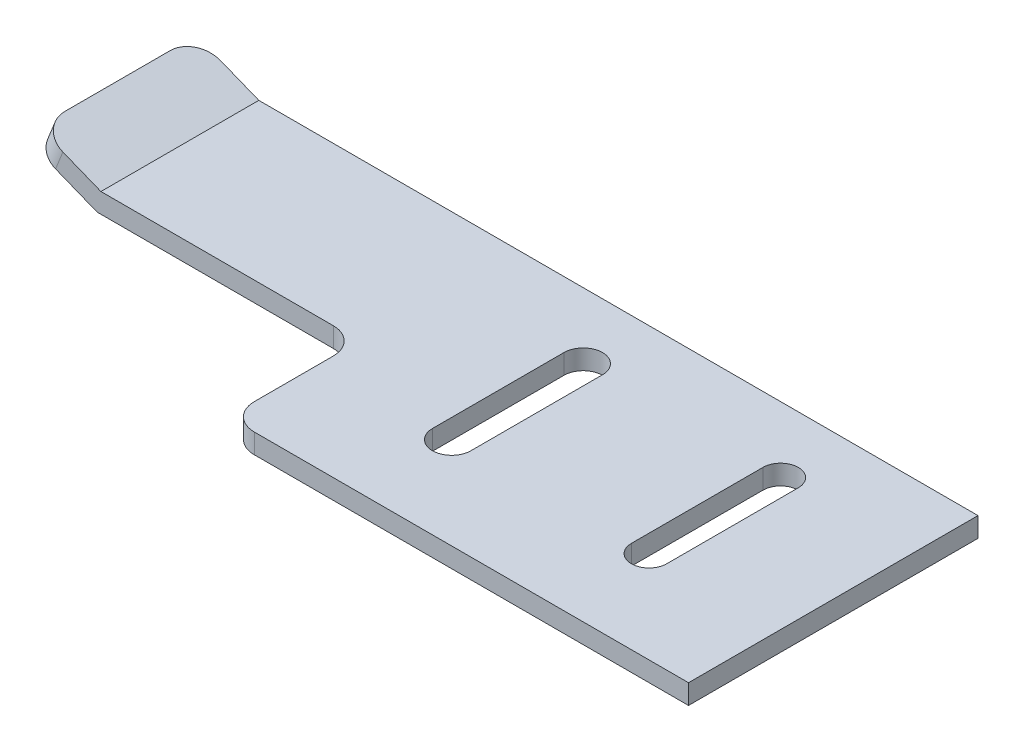
ISO-10303-21;
HEADER;
FILE_DESCRIPTION(('STEP AP214'),'2;1');
FILE_NAME('part.step','',(''),(''),'','','');
FILE_SCHEMA(('AUTOMOTIVE_DESIGN { 1 0 10303 214 1 1 1 1 }'));
ENDSEC;
DATA;
#1=APPLICATION_CONTEXT('core data for automotive mechanical design processes');
#2=APPLICATION_PROTOCOL_DEFINITION('international standard','automotive_design',2000,#1);
#3=PRODUCT_CONTEXT('',#1,'mechanical');
#4=PRODUCT('Part','Part','',(#3));
#5=PRODUCT_RELATED_PRODUCT_CATEGORY('part','',(#4));
#6=PRODUCT_DEFINITION_FORMATION('','',#4);
#7=PRODUCT_DEFINITION_CONTEXT('part definition',#1,'design');
#8=PRODUCT_DEFINITION('design','',#6,#7);
#9=PRODUCT_DEFINITION_SHAPE('','',#8);
#10=(LENGTH_UNIT() NAMED_UNIT(*) SI_UNIT(.MILLI.,.METRE.));
#11=(NAMED_UNIT(*) PLANE_ANGLE_UNIT() SI_UNIT($,.RADIAN.));
#12=(NAMED_UNIT(*) SI_UNIT($,.STERADIAN.) SOLID_ANGLE_UNIT());
#13=UNCERTAINTY_MEASURE_WITH_UNIT(LENGTH_MEASURE(1.E-05),#10,'distance_accuracy_value','');
#14=(GEOMETRIC_REPRESENTATION_CONTEXT(3) GLOBAL_UNCERTAINTY_ASSIGNED_CONTEXT((#13)) GLOBAL_UNIT_ASSIGNED_CONTEXT((#10,
#11,#12)) REPRESENTATION_CONTEXT('',''));
#15=CARTESIAN_POINT('',(0.,0.,0.));
#16=DIRECTION('',(0.,0.,1.));
#17=DIRECTION('',(1.,0.,0.));
#18=AXIS2_PLACEMENT_3D('',#15,#16,#17);
#19=CARTESIAN_POINT('',(-6.98954425613811,7.77511100339449,22.));
#20=DIRECTION('',(-0.3711350848812,-0.928578886670499,0.));
#21=DIRECTION('',(0.928578886670499,-0.3711350848812,0.));
#22=AXIS2_PLACEMENT_3D('',#19,#20,#21);
#23=PLANE('',#22);
#24=DIRECTION('',(-0.928578886670499,0.3711350848812,0.));
#25=VECTOR('',#24,1.);
#26=CARTESIAN_POINT('',(-6.98954425613811,7.77511100339449,0.));
#27=LINE('',#26,#25);
#28=CARTESIAN_POINT('',(-2.24326139015815,5.87811321503025,0.));
#29=VERTEX_POINT('',#28);
#30=CARTESIAN_POINT('',(-5.13238648279711,7.03284083363209,0.));
#31=VERTEX_POINT('',#30);
#32=EDGE_CURVE('E238',#29,#31,#27,.T.);
#33=ORIENTED_EDGE('',*,*,#32,.T.);
#34=CARTESIAN_POINT('',(-5.13238648279711,7.03284083363209,2.));
#35=DIRECTION('',(-0.3711350848812,-0.928578886670499,0.));
#36=DIRECTION('',(0.928578886670499,-0.3711350848812,0.));
#37=AXIS2_PLACEMENT_3D('',#34,#35,#36);
#38=CIRCLE('',#37,2.);
#39=CARTESIAN_POINT('',(-6.98954425613811,7.77511100339449,2.));
#40=VERTEX_POINT('',#39);
#41=EDGE_CURVE('E311',#31,#40,#38,.F.);
#42=ORIENTED_EDGE('',*,*,#41,.T.);
#43=DIRECTION('',(0.,0.,-1.));
#44=VECTOR('',#43,1.);
#45=CARTESIAN_POINT('',(-6.98954425613811,7.77511100339449,22.));
#46=LINE('',#45,#44);
#47=CARTESIAN_POINT('',(-6.98954425613811,7.77511100339449,9.99999999999999));
#48=VERTEX_POINT('',#47);
#49=EDGE_CURVE('E270',#48,#40,#46,.T.);
#50=ORIENTED_EDGE('',*,*,#49,.F.);
#51=CARTESIAN_POINT('',(-5.13238648279711,7.03284083363209,9.99999999999999));
#52=DIRECTION('',(-0.3711350848812,-0.928578886670499,0.));
#53=DIRECTION('',(0.928578886670499,-0.3711350848812,0.));
#54=AXIS2_PLACEMENT_3D('',#51,#52,#53);
#55=CIRCLE('',#54,2.);
#56=CARTESIAN_POINT('',(-5.13238648279711,7.03284083363209,12.));
#57=VERTEX_POINT('',#56);
#58=EDGE_CURVE('E309',#48,#57,#55,.F.);
#59=ORIENTED_EDGE('',*,*,#58,.T.);
#60=DIRECTION('',(0.928578886670499,-0.3711350848812,0.));
#61=VECTOR('',#60,1.);
#62=CARTESIAN_POINT('',(-6.98954425613811,7.77511100339449,12.));
#63=LINE('',#62,#61);
#64=CARTESIAN_POINT('',(-2.24326139015815,5.87811321503025,12.));
#65=VERTEX_POINT('',#64);
#66=EDGE_CURVE('E233',#57,#65,#63,.T.);
#67=ORIENTED_EDGE('',*,*,#66,.T.);
#68=DIRECTION('',(0.,0.,-1.));
#69=VECTOR('',#68,1.);
#70=CARTESIAN_POINT('',(-2.24326139015815,5.87811321503025,22.));
#71=LINE('',#70,#69);
#72=EDGE_CURVE('E246',#65,#29,#71,.T.);
#73=ORIENTED_EDGE('',*,*,#72,.T.);
#74=EDGE_LOOP('',(#33,#42,#50,#59,#67,#73));
#75=FACE_BOUND('',#74,.T.);
#76=ADVANCED_FACE('F33',(#75),#23,.F.);
#77=CARTESIAN_POINT('',(-7.54624688345991,6.38224267338874,22.));
#78=DIRECTION('',(0.928578886670499,-0.371135084881201,0.));
#79=DIRECTION('',(0.371135084881201,0.928578886670499,0.));
#80=AXIS2_PLACEMENT_3D('',#77,#78,#79);
#81=PLANE('',#80);
#82=ORIENTED_EDGE('',*,*,#49,.T.);
#83=DIRECTION('',(-0.371135084881201,-0.928578886670499,0.));
#84=VECTOR('',#83,1.);
#85=CARTESIAN_POINT('',(-7.54624688345991,6.38224267338874,2.));
#86=LINE('',#85,#84);
#87=CARTESIAN_POINT('',(-7.54624688345991,6.38224267338874,2.));
#88=VERTEX_POINT('',#87);
#89=EDGE_CURVE('E300',#40,#88,#86,.T.);
#90=ORIENTED_EDGE('',*,*,#89,.T.);
#91=DIRECTION('',(0.,0.,-1.));
#92=VECTOR('',#91,1.);
#93=CARTESIAN_POINT('',(-7.54624688345991,6.38224267338874,22.));
#94=LINE('',#93,#92);
#95=CARTESIAN_POINT('',(-7.54624688345991,6.38224267338874,9.99999999999999));
#96=VERTEX_POINT('',#95);
#97=EDGE_CURVE('E267',#96,#88,#94,.T.);
#98=ORIENTED_EDGE('',*,*,#97,.F.);
#99=DIRECTION('',(0.371135084881201,0.928578886670499,0.));
#100=VECTOR('',#99,1.);
#101=CARTESIAN_POINT('',(-7.54624688345991,6.38224267338874,9.99999999999999));
#102=LINE('',#101,#100);
#103=EDGE_CURVE('E297',#96,#48,#102,.T.);
#104=ORIENTED_EDGE('',*,*,#103,.T.);
#105=EDGE_LOOP('',(#82,#90,#98,#104));
#106=FACE_BOUND('',#105,.T.);
#107=ADVANCED_FACE('F369',(#106),#81,.F.);
#108=CARTESIAN_POINT('',(-2.53192089543921,4.37811321503025,22.));
#109=DIRECTION('',(0.3711350848812,0.928578886670499,0.));
#110=DIRECTION('',(-0.928578886670499,0.3711350848812,0.));
#111=AXIS2_PLACEMENT_3D('',#108,#109,#110);
#112=PLANE('',#111);
#113=ORIENTED_EDGE('',*,*,#97,.T.);
#114=CARTESIAN_POINT('',(-5.68908911011891,5.63997250362634,2.));
#115=DIRECTION('',(0.3711350848812,0.928578886670499,0.));
#116=DIRECTION('',(-0.928578886670499,0.3711350848812,0.));
#117=AXIS2_PLACEMENT_3D('',#114,#115,#116);
#118=CIRCLE('',#117,2.);
#119=CARTESIAN_POINT('',(-5.68908911011891,5.63997250362634,0.));
#120=VERTEX_POINT('',#119);
#121=EDGE_CURVE('E305',#88,#120,#118,.F.);
#122=ORIENTED_EDGE('',*,*,#121,.T.);
#123=DIRECTION('',(0.928578886670499,-0.3711350848812,0.));
#124=VECTOR('',#123,1.);
#125=CARTESIAN_POINT('',(-2.53192089543921,4.37811321503025,0.));
#126=LINE('',#125,#124);
#127=CARTESIAN_POINT('',(-2.53192089543921,4.37811321503025,0.));
#128=VERTEX_POINT('',#127);
#129=EDGE_CURVE('E249',#120,#128,#126,.T.);
#130=ORIENTED_EDGE('',*,*,#129,.T.);
#131=DIRECTION('',(0.,0.,-1.));
#132=VECTOR('',#131,1.);
#133=CARTESIAN_POINT('',(-2.53192089543921,4.37811321503025,22.));
#134=LINE('',#133,#132);
#135=CARTESIAN_POINT('',(-2.53192089543921,4.37811321503025,12.));
#136=VERTEX_POINT('',#135);
#137=EDGE_CURVE('E264',#136,#128,#134,.T.);
#138=ORIENTED_EDGE('',*,*,#137,.F.);
#139=DIRECTION('',(-0.928578886670499,0.3711350848812,0.));
#140=VECTOR('',#139,1.);
#141=CARTESIAN_POINT('',(-2.53192089543921,4.37811321503025,12.));
#142=LINE('',#141,#140);
#143=CARTESIAN_POINT('',(-5.68908911011891,5.63997250362634,12.));
#144=VERTEX_POINT('',#143);
#145=EDGE_CURVE('E235',#136,#144,#142,.T.);
#146=ORIENTED_EDGE('',*,*,#145,.T.);
#147=CARTESIAN_POINT('',(-5.68908911011891,5.63997250362634,9.99999999999999));
#148=DIRECTION('',(0.3711350848812,0.928578886670499,0.));
#149=DIRECTION('',(-0.928578886670499,0.3711350848812,0.));
#150=AXIS2_PLACEMENT_3D('',#147,#148,#149);
#151=CIRCLE('',#150,2.);
#152=EDGE_CURVE('E303',#144,#96,#151,.F.);
#153=ORIENTED_EDGE('',*,*,#152,.T.);
#154=EDGE_LOOP('',(#113,#122,#130,#138,#146,#153));
#155=FACE_BOUND('',#154,.T.);
#156=ADVANCED_FACE('F372',(#155),#112,.F.);
#157=CARTESIAN_POINT('',(-2.53192089543921,4.37811321503025,22.));
#158=DIRECTION('',(0.,1.,0.));
#159=DIRECTION('',(0.,0.,1.));
#160=AXIS2_PLACEMENT_3D('',#157,#158,#159);
#161=PLANE('',#160);
#162=DIRECTION('',(0.,0.,-1.));
#163=VECTOR('',#162,1.);
#164=CARTESIAN_POINT('',(25.9506197674703,4.37811321503025,15.));
#165=LINE('',#164,#163);
#166=CARTESIAN_POINT('',(25.9506197674703,4.37811321503025,15.));
#167=VERTEX_POINT('',#166);
#168=CARTESIAN_POINT('',(25.9506197674703,4.37811321503025,5.));
#169=VERTEX_POINT('',#168);
#170=EDGE_CURVE('E186',#167,#169,#165,.T.);
#171=ORIENTED_EDGE('',*,*,#170,.F.);
#172=CARTESIAN_POINT('',(27.4137531165401,4.37811321503025,15.));
#173=DIRECTION('',(0.,-1.,0.));
#174=DIRECTION('',(0.,0.,-1.));
#175=AXIS2_PLACEMENT_3D('',#172,#173,#174);
#176=CIRCLE('',#175,1.46313334906978);
#177=CARTESIAN_POINT('',(28.8768864656099,4.37811321503025,15.));
#178=VERTEX_POINT('',#177);
#179=EDGE_CURVE('E191',#178,#167,#176,.T.);
#180=ORIENTED_EDGE('',*,*,#179,.F.);
#181=DIRECTION('',(0.,0.,1.));
#182=VECTOR('',#181,1.);
#183=CARTESIAN_POINT('',(28.8768864656099,4.37811321503025,15.));
#184=LINE('',#183,#182);
#185=CARTESIAN_POINT('',(28.8768864656099,4.37811321503025,5.));
#186=VERTEX_POINT('',#185);
#187=EDGE_CURVE('E196',#186,#178,#184,.T.);
#188=ORIENTED_EDGE('',*,*,#187,.F.);
#189=CARTESIAN_POINT('',(27.4137531165401,4.37811321503025,5.));
#190=DIRECTION('',(0.,-1.,0.));
#191=DIRECTION('',(0.,0.,-1.));
#192=AXIS2_PLACEMENT_3D('',#189,#190,#191);
#193=CIRCLE('',#192,1.46313334906978);
#194=EDGE_CURVE('E175',#169,#186,#193,.T.);
#195=ORIENTED_EDGE('',*,*,#194,.F.);
#196=EDGE_LOOP('',(#171,#180,#188,#195));
#197=FACE_BOUND('',#196,.T.);
#198=DIRECTION('',(0.,0.,-1.));
#199=VECTOR('',#198,1.);
#200=CARTESIAN_POINT('',(41.0704553373589,4.37811321503025,15.));
#201=LINE('',#200,#199);
#202=CARTESIAN_POINT('',(41.0704553373589,4.37811321503025,15.));
#203=VERTEX_POINT('',#202);
#204=CARTESIAN_POINT('',(41.0704553373589,4.37811321503025,5.));
#205=VERTEX_POINT('',#204);
#206=EDGE_CURVE('E208',#203,#205,#201,.T.);
#207=ORIENTED_EDGE('',*,*,#206,.F.);
#208=CARTESIAN_POINT('',(42.4137531165401,4.37811321503025,15.));
#209=DIRECTION('',(0.,-1.,0.));
#210=DIRECTION('',(0.,0.,-1.));
#211=AXIS2_PLACEMENT_3D('',#208,#209,#210);
#212=CIRCLE('',#211,1.34329777918119);
#213=CARTESIAN_POINT('',(43.7570508957213,4.37811321503025,15.));
#214=VERTEX_POINT('',#213);
#215=EDGE_CURVE('E206',#214,#203,#212,.T.);
#216=ORIENTED_EDGE('',*,*,#215,.F.);
#217=DIRECTION('',(0.,0.,1.));
#218=VECTOR('',#217,1.);
#219=CARTESIAN_POINT('',(43.7570508957213,4.37811321503025,15.));
#220=LINE('',#219,#218);
#221=CARTESIAN_POINT('',(43.7570508957213,4.37811321503025,5.));
#222=VERTEX_POINT('',#221);
#223=EDGE_CURVE('E214',#222,#214,#220,.T.);
#224=ORIENTED_EDGE('',*,*,#223,.F.);
#225=CARTESIAN_POINT('',(42.4137531165401,4.37811321503025,5.));
#226=DIRECTION('',(0.,-1.,0.));
#227=DIRECTION('',(0.,0.,-1.));
#228=AXIS2_PLACEMENT_3D('',#225,#226,#227);
#229=CIRCLE('',#228,1.34329777918119);
#230=EDGE_CURVE('E211',#205,#222,#229,.T.);
#231=ORIENTED_EDGE('',*,*,#230,.F.);
#232=EDGE_LOOP('',(#207,#216,#224,#231));
#233=FACE_BOUND('',#232,.T.);
#234=DIRECTION('',(1.,0.,0.));
#235=VECTOR('',#234,1.);
#236=CARTESIAN_POINT('',(-2.53192089543921,4.37811321503025,22.));
#237=LINE('',#236,#235);
#238=CARTESIAN_POINT('',(19.4137531165401,4.37811321503025,22.));
#239=VERTEX_POINT('',#238);
#240=CARTESIAN_POINT('',(52.4137531165401,4.37811321503025,22.));
#241=VERTEX_POINT('',#240);
#242=EDGE_CURVE('E239',#239,#241,#237,.T.);
#243=ORIENTED_EDGE('',*,*,#242,.F.);
#244=CARTESIAN_POINT('',(19.4137531165401,4.37811321503025,20.));
#245=DIRECTION('',(0.,1.,0.));
#246=DIRECTION('',(0.,0.,1.));
#247=AXIS2_PLACEMENT_3D('',#244,#245,#246);
#248=CIRCLE('',#247,2.);
#249=CARTESIAN_POINT('',(17.4137531165401,4.37811321503025,20.));
#250=VERTEX_POINT('',#249);
#251=EDGE_CURVE('E325',#239,#250,#248,.F.);
#252=ORIENTED_EDGE('',*,*,#251,.T.);
#253=DIRECTION('',(0.,0.,1.));
#254=VECTOR('',#253,1.);
#255=CARTESIAN_POINT('',(17.4137531165401,4.37811321503025,22.));
#256=LINE('',#255,#254);
#257=CARTESIAN_POINT('',(17.4137531165401,4.37811321503025,14.));
#258=VERTEX_POINT('',#257);
#259=EDGE_CURVE('E203',#258,#250,#256,.T.);
#260=ORIENTED_EDGE('',*,*,#259,.F.);
#261=CARTESIAN_POINT('',(15.4137531165401,4.37811321503025,14.));
#262=DIRECTION('',(0.,1.,0.));
#263=DIRECTION('',(0.,0.,1.));
#264=AXIS2_PLACEMENT_3D('',#261,#262,#263);
#265=CIRCLE('',#264,2.);
#266=CARTESIAN_POINT('',(15.4137531165401,4.37811321503025,12.));
#267=VERTEX_POINT('',#266);
#268=EDGE_CURVE('E41',#258,#267,#265,.T.);
#269=ORIENTED_EDGE('',*,*,#268,.T.);
#270=DIRECTION('',(1.,0.,0.));
#271=VECTOR('',#270,1.);
#272=CARTESIAN_POINT('',(17.4137531165401,4.37811321503025,12.));
#273=LINE('',#272,#271);
#274=EDGE_CURVE('E228',#136,#267,#273,.T.);
#275=ORIENTED_EDGE('',*,*,#274,.F.);
#276=ORIENTED_EDGE('',*,*,#137,.T.);
#277=DIRECTION('',(1.,0.,0.));
#278=VECTOR('',#277,1.);
#279=CARTESIAN_POINT('',(-2.53192089543921,4.37811321503025,0.));
#280=LINE('',#279,#278);
#281=CARTESIAN_POINT('',(52.4137531165401,4.37811321503025,0.));
#282=VERTEX_POINT('',#281);
#283=EDGE_CURVE('E251',#128,#282,#280,.T.);
#284=ORIENTED_EDGE('',*,*,#283,.T.);
#285=DIRECTION('',(0.,0.,-1.));
#286=VECTOR('',#285,1.);
#287=CARTESIAN_POINT('',(52.4137531165401,4.37811321503025,22.));
#288=LINE('',#287,#286);
#289=EDGE_CURVE('E261',#241,#282,#288,.T.);
#290=ORIENTED_EDGE('',*,*,#289,.F.);
#291=EDGE_LOOP('',(#243,#252,#260,#269,#275,#276,#284,#290));
#292=FACE_BOUND('',#291,.T.);
#293=ADVANCED_FACE('F193',(#197,#233,#292),#161,.F.);
#294=CARTESIAN_POINT('',(52.4137531165401,5.87811321503025,22.));
#295=DIRECTION('',(-1.,0.,0.));
#296=DIRECTION('',(0.,0.,1.));
#297=AXIS2_PLACEMENT_3D('',#294,#295,#296);
#298=PLANE('',#297);
#299=DIRECTION('',(0.,1.,0.));
#300=VECTOR('',#299,1.);
#301=CARTESIAN_POINT('',(52.4137531165401,5.87811321503025,0.));
#302=LINE('',#301,#300);
#303=CARTESIAN_POINT('',(52.4137531165401,5.87811321503025,0.));
#304=VERTEX_POINT('',#303);
#305=EDGE_CURVE('E253',#282,#304,#302,.T.);
#306=ORIENTED_EDGE('',*,*,#305,.T.);
#307=DIRECTION('',(0.,0.,-1.));
#308=VECTOR('',#307,1.);
#309=CARTESIAN_POINT('',(52.4137531165401,5.87811321503025,22.));
#310=LINE('',#309,#308);
#311=CARTESIAN_POINT('',(52.4137531165401,5.87811321503025,22.));
#312=VERTEX_POINT('',#311);
#313=EDGE_CURVE('E258',#312,#304,#310,.T.);
#314=ORIENTED_EDGE('',*,*,#313,.F.);
#315=DIRECTION('',(0.,1.,0.));
#316=VECTOR('',#315,1.);
#317=CARTESIAN_POINT('',(52.4137531165401,5.87811321503025,22.));
#318=LINE('',#317,#316);
#319=EDGE_CURVE('E241',#241,#312,#318,.T.);
#320=ORIENTED_EDGE('',*,*,#319,.F.);
#321=ORIENTED_EDGE('',*,*,#289,.T.);
#322=EDGE_LOOP('',(#306,#314,#320,#321));
#323=FACE_BOUND('',#322,.T.);
#324=ADVANCED_FACE('F352',(#323),#298,.F.);
#325=CARTESIAN_POINT('',(-2.24326139015815,5.87811321503025,22.));
#326=DIRECTION('',(0.,-1.,0.));
#327=DIRECTION('',(0.,0.,-1.));
#328=AXIS2_PLACEMENT_3D('',#325,#326,#327);
#329=PLANE('',#328);
#330=DIRECTION('',(0.,0.,1.));
#331=VECTOR('',#330,1.);
#332=CARTESIAN_POINT('',(28.8768864656099,5.87811321503025,22.));
#333=LINE('',#332,#331);
#334=CARTESIAN_POINT('',(28.8768864656099,5.87811321503025,5.));
#335=VERTEX_POINT('',#334);
#336=CARTESIAN_POINT('',(28.8768864656099,5.87811321503025,15.));
#337=VERTEX_POINT('',#336);
#338=EDGE_CURVE('E291',#335,#337,#333,.T.);
#339=ORIENTED_EDGE('',*,*,#338,.T.);
#340=CARTESIAN_POINT('',(27.4137531165401,5.87811321503025,15.));
#341=DIRECTION('',(0.,-1.,0.));
#342=DIRECTION('',(0.,0.,-1.));
#343=AXIS2_PLACEMENT_3D('',#340,#341,#342);
#344=CIRCLE('',#343,1.46313334906978);
#345=CARTESIAN_POINT('',(25.9506197674703,5.87811321503025,15.));
#346=VERTEX_POINT('',#345);
#347=EDGE_CURVE('E294',#337,#346,#344,.T.);
#348=ORIENTED_EDGE('',*,*,#347,.T.);
#349=DIRECTION('',(0.,0.,-1.));
#350=VECTOR('',#349,1.);
#351=CARTESIAN_POINT('',(25.9506197674703,5.87811321503025,22.));
#352=LINE('',#351,#350);
#353=CARTESIAN_POINT('',(25.9506197674703,5.87811321503025,5.));
#354=VERTEX_POINT('',#353);
#355=EDGE_CURVE('E288',#346,#354,#352,.T.);
#356=ORIENTED_EDGE('',*,*,#355,.T.);
#357=CARTESIAN_POINT('',(27.4137531165401,5.87811321503025,5.));
#358=DIRECTION('',(0.,-1.,0.));
#359=DIRECTION('',(0.,0.,-1.));
#360=AXIS2_PLACEMENT_3D('',#357,#358,#359);
#361=CIRCLE('',#360,1.46313334906978);
#362=EDGE_CURVE('E178',#354,#335,#361,.T.);
#363=ORIENTED_EDGE('',*,*,#362,.T.);
#364=EDGE_LOOP('',(#339,#348,#356,#363));
#365=FACE_BOUND('',#364,.T.);
#366=DIRECTION('',(0.,0.,1.));
#367=VECTOR('',#366,1.);
#368=CARTESIAN_POINT('',(43.7570508957213,5.87811321503025,22.));
#369=LINE('',#368,#367);
#370=CARTESIAN_POINT('',(43.7570508957213,5.87811321503025,5.));
#371=VERTEX_POINT('',#370);
#372=CARTESIAN_POINT('',(43.7570508957213,5.87811321503025,15.));
#373=VERTEX_POINT('',#372);
#374=EDGE_CURVE('E282',#371,#373,#369,.T.);
#375=ORIENTED_EDGE('',*,*,#374,.T.);
#376=CARTESIAN_POINT('',(42.4137531165401,5.87811321503025,15.));
#377=DIRECTION('',(0.,-1.,0.));
#378=DIRECTION('',(0.,0.,-1.));
#379=AXIS2_PLACEMENT_3D('',#376,#377,#378);
#380=CIRCLE('',#379,1.34329777918119);
#381=CARTESIAN_POINT('',(41.0704553373589,5.87811321503025,15.));
#382=VERTEX_POINT('',#381);
#383=EDGE_CURVE('E285',#373,#382,#380,.T.);
#384=ORIENTED_EDGE('',*,*,#383,.T.);
#385=DIRECTION('',(0.,0.,-1.));
#386=VECTOR('',#385,1.);
#387=CARTESIAN_POINT('',(41.0704553373589,5.87811321503025,22.));
#388=LINE('',#387,#386);
#389=CARTESIAN_POINT('',(41.0704553373589,5.87811321503025,5.));
#390=VERTEX_POINT('',#389);
#391=EDGE_CURVE('E276',#382,#390,#388,.T.);
#392=ORIENTED_EDGE('',*,*,#391,.T.);
#393=CARTESIAN_POINT('',(42.4137531165401,5.87811321503025,5.));
#394=DIRECTION('',(0.,-1.,0.));
#395=DIRECTION('',(0.,0.,-1.));
#396=AXIS2_PLACEMENT_3D('',#393,#394,#395);
#397=CIRCLE('',#396,1.34329777918119);
#398=EDGE_CURVE('E279',#390,#371,#397,.T.);
#399=ORIENTED_EDGE('',*,*,#398,.T.);
#400=EDGE_LOOP('',(#375,#384,#392,#399));
#401=FACE_BOUND('',#400,.T.);
#402=DIRECTION('',(0.,0.,1.));
#403=VECTOR('',#402,1.);
#404=CARTESIAN_POINT('',(17.4137531165401,5.87811321503025,22.));
#405=LINE('',#404,#403);
#406=CARTESIAN_POINT('',(17.4137531165401,5.87811321503025,14.));
#407=VERTEX_POINT('',#406);
#408=CARTESIAN_POINT('',(17.4137531165401,5.87811321503025,20.));
#409=VERTEX_POINT('',#408);
#410=EDGE_CURVE('E231',#407,#409,#405,.T.);
#411=ORIENTED_EDGE('',*,*,#410,.T.);
#412=CARTESIAN_POINT('',(19.4137531165401,5.87811321503025,20.));
#413=DIRECTION('',(0.,-1.,0.));
#414=DIRECTION('',(0.,0.,-1.));
#415=AXIS2_PLACEMENT_3D('',#412,#413,#414);
#416=CIRCLE('',#415,2.);
#417=CARTESIAN_POINT('',(19.4137531165401,5.87811321503025,22.));
#418=VERTEX_POINT('',#417);
#419=EDGE_CURVE('E56',#409,#418,#416,.F.);
#420=ORIENTED_EDGE('',*,*,#419,.T.);
#421=DIRECTION('',(-1.,0.,0.));
#422=VECTOR('',#421,1.);
#423=CARTESIAN_POINT('',(-2.24326139015815,5.87811321503025,22.));
#424=LINE('',#423,#422);
#425=EDGE_CURVE('E244',#312,#418,#424,.T.);
#426=ORIENTED_EDGE('',*,*,#425,.F.);
#427=ORIENTED_EDGE('',*,*,#313,.T.);
#428=DIRECTION('',(-1.,0.,0.));
#429=VECTOR('',#428,1.);
#430=CARTESIAN_POINT('',(-2.24326139015815,5.87811321503025,0.));
#431=LINE('',#430,#429);
#432=EDGE_CURVE('E242',#304,#29,#431,.T.);
#433=ORIENTED_EDGE('',*,*,#432,.T.);
#434=ORIENTED_EDGE('',*,*,#72,.F.);
#435=DIRECTION('',(1.,0.,0.));
#436=VECTOR('',#435,1.);
#437=CARTESIAN_POINT('',(-2.24326139015815,5.87811321503025,12.));
#438=LINE('',#437,#436);
#439=CARTESIAN_POINT('',(15.4137531165401,5.87811321503025,12.));
#440=VERTEX_POINT('',#439);
#441=EDGE_CURVE('E273',#65,#440,#438,.T.);
#442=ORIENTED_EDGE('',*,*,#441,.T.);
#443=CARTESIAN_POINT('',(15.4137531165401,5.87811321503025,14.));
#444=DIRECTION('',(0.,-1.,0.));
#445=DIRECTION('',(0.,0.,-1.));
#446=AXIS2_PLACEMENT_3D('',#443,#444,#445);
#447=CIRCLE('',#446,2.);
#448=EDGE_CURVE('E11',#440,#407,#447,.T.);
#449=ORIENTED_EDGE('',*,*,#448,.T.);
#450=EDGE_LOOP('',(#411,#420,#426,#427,#433,#434,#442,#449));
#451=FACE_BOUND('',#450,.T.);
#452=ADVANCED_FACE('F340',(#365,#401,#451),#329,.F.);
#453=CARTESIAN_POINT('',(0.,0.,22.));
#454=DIRECTION('',(0.,0.,1.));
#455=DIRECTION('',(1.,0.,0.));
#456=AXIS2_PLACEMENT_3D('',#453,#454,#455);
#457=PLANE('',#456);
#458=ORIENTED_EDGE('',*,*,#425,.T.);
#459=DIRECTION('',(0.,1.,0.));
#460=VECTOR('',#459,1.);
#461=CARTESIAN_POINT('',(19.4137531165401,4.37811321503025,22.));
#462=LINE('',#461,#460);
#463=EDGE_CURVE('E48',#418,#239,#462,.F.);
#464=ORIENTED_EDGE('',*,*,#463,.T.);
#465=ORIENTED_EDGE('',*,*,#242,.T.);
#466=ORIENTED_EDGE('',*,*,#319,.T.);
#467=EDGE_LOOP('',(#458,#464,#465,#466));
#468=FACE_BOUND('',#467,.T.);
#469=ADVANCED_FACE('F349',(#468),#457,.T.);
#470=CARTESIAN_POINT('',(0.,0.,0.));
#471=DIRECTION('',(0.,0.,1.));
#472=DIRECTION('',(1.,0.,0.));
#473=AXIS2_PLACEMENT_3D('',#470,#471,#472);
#474=PLANE('',#473);
#475=ORIENTED_EDGE('',*,*,#129,.F.);
#476=DIRECTION('',(-0.371135084881201,-0.928578886670499,0.));
#477=VECTOR('',#476,1.);
#478=CARTESIAN_POINT('',(-6.84916045183524,2.73747743153117,0.));
#479=LINE('',#478,#477);
#480=EDGE_CURVE('E307',#120,#31,#479,.F.);
#481=ORIENTED_EDGE('',*,*,#480,.T.);
#482=ORIENTED_EDGE('',*,*,#32,.F.);
#483=ORIENTED_EDGE('',*,*,#432,.F.);
#484=ORIENTED_EDGE('',*,*,#305,.F.);
#485=ORIENTED_EDGE('',*,*,#283,.F.);
#486=EDGE_LOOP('',(#475,#481,#482,#483,#484,#485));
#487=FACE_BOUND('',#486,.T.);
#488=ADVANCED_FACE('F358',(#487),#474,.F.);
#489=CARTESIAN_POINT('',(17.4137531165401,26.3781132150303,12.));
#490=DIRECTION('',(0.,0.,-1.));
#491=DIRECTION('',(-1.,0.,0.));
#492=AXIS2_PLACEMENT_3D('',#489,#490,#491);
#493=PLANE('',#492);
#494=ORIENTED_EDGE('',*,*,#66,.F.);
#495=DIRECTION('',(0.371135084881201,0.928578886670499,0.));
#496=VECTOR('',#495,1.);
#497=CARTESIAN_POINT('',(4.64007347122597,31.4835067873603,12.));
#498=LINE('',#497,#496);
#499=EDGE_CURVE('E315',#57,#144,#498,.F.);
#500=ORIENTED_EDGE('',*,*,#499,.T.);
#501=ORIENTED_EDGE('',*,*,#145,.F.);
#502=ORIENTED_EDGE('',*,*,#274,.T.);
#503=DIRECTION('',(0.,-1.,0.));
#504=VECTOR('',#503,1.);
#505=CARTESIAN_POINT('',(15.4137531165401,5.87811321503025,12.));
#506=LINE('',#505,#504);
#507=EDGE_CURVE('E313',#267,#440,#506,.F.);
#508=ORIENTED_EDGE('',*,*,#507,.T.);
#509=ORIENTED_EDGE('',*,*,#441,.F.);
#510=EDGE_LOOP('',(#494,#500,#501,#502,#508,#509));
#511=FACE_BOUND('',#510,.T.);
#512=ADVANCED_FACE('F335',(#511),#493,.F.);
#513=CARTESIAN_POINT('',(17.4137531165401,26.3781132150303,22.));
#514=DIRECTION('',(1.,0.,0.));
#515=DIRECTION('',(0.,0.,-1.));
#516=AXIS2_PLACEMENT_3D('',#513,#514,#515);
#517=PLANE('',#516);
#518=ORIENTED_EDGE('',*,*,#410,.F.);
#519=DIRECTION('',(0.,-1.,0.));
#520=VECTOR('',#519,1.);
#521=CARTESIAN_POINT('',(17.4137531165401,4.37811321503025,14.));
#522=LINE('',#521,#520);
#523=EDGE_CURVE('E320',#407,#258,#522,.T.);
#524=ORIENTED_EDGE('',*,*,#523,.T.);
#525=ORIENTED_EDGE('',*,*,#259,.T.);
#526=DIRECTION('',(0.,1.,0.));
#527=VECTOR('',#526,1.);
#528=CARTESIAN_POINT('',(17.4137531165401,5.87811321503025,20.));
#529=LINE('',#528,#527);
#530=EDGE_CURVE('E317',#250,#409,#529,.T.);
#531=ORIENTED_EDGE('',*,*,#530,.T.);
#532=EDGE_LOOP('',(#518,#524,#525,#531));
#533=FACE_BOUND('',#532,.T.);
#534=ADVANCED_FACE('F343',(#533),#517,.F.);
#535=CARTESIAN_POINT('',(42.4137531165401,26.3781132150303,15.));
#536=DIRECTION('',(0.,-1.,0.));
#537=DIRECTION('',(0.,0.,-1.));
#538=AXIS2_PLACEMENT_3D('',#535,#536,#537);
#539=CYLINDRICAL_SURFACE('',#538,1.34329777918119);
#540=DIRECTION('',(0.,-1.,0.));
#541=VECTOR('',#540,1.);
#542=CARTESIAN_POINT('',(43.7570508957213,26.3781132150303,15.));
#543=LINE('',#542,#541);
#544=EDGE_CURVE('E218',#373,#214,#543,.T.);
#545=ORIENTED_EDGE('',*,*,#544,.T.);
#546=ORIENTED_EDGE('',*,*,#215,.T.);
#547=DIRECTION('',(0.,-1.,0.));
#548=VECTOR('',#547,1.);
#549=CARTESIAN_POINT('',(41.0704553373589,26.3781132150303,15.));
#550=LINE('',#549,#548);
#551=EDGE_CURVE('E217',#382,#203,#550,.T.);
#552=ORIENTED_EDGE('',*,*,#551,.F.);
#553=ORIENTED_EDGE('',*,*,#383,.F.);
#554=EDGE_LOOP('',(#545,#546,#552,#553));
#555=FACE_BOUND('',#554,.T.);
#556=ADVANCED_FACE('F406',(#555),#539,.F.);
#557=CARTESIAN_POINT('',(43.7570508957213,26.3781132150303,15.));
#558=DIRECTION('',(1.,0.,0.));
#559=DIRECTION('',(0.,0.,-1.));
#560=AXIS2_PLACEMENT_3D('',#557,#558,#559);
#561=PLANE('',#560);
#562=DIRECTION('',(0.,-1.,0.));
#563=VECTOR('',#562,1.);
#564=CARTESIAN_POINT('',(43.7570508957213,26.3781132150303,5.));
#565=LINE('',#564,#563);
#566=EDGE_CURVE('E220',#371,#222,#565,.T.);
#567=ORIENTED_EDGE('',*,*,#566,.T.);
#568=ORIENTED_EDGE('',*,*,#223,.T.);
#569=ORIENTED_EDGE('',*,*,#544,.F.);
#570=ORIENTED_EDGE('',*,*,#374,.F.);
#571=EDGE_LOOP('',(#567,#568,#569,#570));
#572=FACE_BOUND('',#571,.T.);
#573=ADVANCED_FACE('F411',(#572),#561,.F.);
#574=CARTESIAN_POINT('',(42.4137531165401,26.3781132150303,5.));
#575=DIRECTION('',(0.,-1.,0.));
#576=DIRECTION('',(0.,0.,-1.));
#577=AXIS2_PLACEMENT_3D('',#574,#575,#576);
#578=CYLINDRICAL_SURFACE('',#577,1.34329777918119);
#579=DIRECTION('',(0.,-1.,0.));
#580=VECTOR('',#579,1.);
#581=CARTESIAN_POINT('',(41.0704553373589,26.3781132150303,5.));
#582=LINE('',#581,#580);
#583=EDGE_CURVE('E222',#390,#205,#582,.T.);
#584=ORIENTED_EDGE('',*,*,#583,.T.);
#585=ORIENTED_EDGE('',*,*,#230,.T.);
#586=ORIENTED_EDGE('',*,*,#566,.F.);
#587=ORIENTED_EDGE('',*,*,#398,.F.);
#588=EDGE_LOOP('',(#584,#585,#586,#587));
#589=FACE_BOUND('',#588,.T.);
#590=ADVANCED_FACE('F417',(#589),#578,.F.);
#591=CARTESIAN_POINT('',(41.0704553373589,26.3781132150303,15.));
#592=DIRECTION('',(-1.,0.,0.));
#593=DIRECTION('',(0.,0.,1.));
#594=AXIS2_PLACEMENT_3D('',#591,#592,#593);
#595=PLANE('',#594);
#596=ORIENTED_EDGE('',*,*,#551,.T.);
#597=ORIENTED_EDGE('',*,*,#206,.T.);
#598=ORIENTED_EDGE('',*,*,#583,.F.);
#599=ORIENTED_EDGE('',*,*,#391,.F.);
#600=EDGE_LOOP('',(#596,#597,#598,#599));
#601=FACE_BOUND('',#600,.T.);
#602=ADVANCED_FACE('F413',(#601),#595,.F.);
#603=CARTESIAN_POINT('',(27.4137531165401,26.3781132150303,15.));
#604=DIRECTION('',(0.,-1.,0.));
#605=DIRECTION('',(0.,0.,-1.));
#606=AXIS2_PLACEMENT_3D('',#603,#604,#605);
#607=CYLINDRICAL_SURFACE('',#606,1.46313334906978);
#608=DIRECTION('',(0.,-1.,0.));
#609=VECTOR('',#608,1.);
#610=CARTESIAN_POINT('',(28.8768864656099,26.3781132150303,15.));
#611=LINE('',#610,#609);
#612=EDGE_CURVE('E201',#337,#178,#611,.T.);
#613=ORIENTED_EDGE('',*,*,#612,.T.);
#614=ORIENTED_EDGE('',*,*,#179,.T.);
#615=DIRECTION('',(0.,-1.,0.));
#616=VECTOR('',#615,1.);
#617=CARTESIAN_POINT('',(25.9506197674703,26.3781132150303,15.));
#618=LINE('',#617,#616);
#619=EDGE_CURVE('E182',#346,#167,#618,.T.);
#620=ORIENTED_EDGE('',*,*,#619,.F.);
#621=ORIENTED_EDGE('',*,*,#347,.F.);
#622=EDGE_LOOP('',(#613,#614,#620,#621));
#623=FACE_BOUND('',#622,.T.);
#624=ADVANCED_FACE('F416',(#623),#607,.F.);
#625=CARTESIAN_POINT('',(28.8768864656099,26.3781132150303,15.));
#626=DIRECTION('',(1.,0.,0.));
#627=DIRECTION('',(0.,0.,-1.));
#628=AXIS2_PLACEMENT_3D('',#625,#626,#627);
#629=PLANE('',#628);
#630=DIRECTION('',(0.,-1.,0.));
#631=VECTOR('',#630,1.);
#632=CARTESIAN_POINT('',(28.8768864656099,26.3781132150303,5.));
#633=LINE('',#632,#631);
#634=EDGE_CURVE('E181',#335,#186,#633,.T.);
#635=ORIENTED_EDGE('',*,*,#634,.T.);
#636=ORIENTED_EDGE('',*,*,#187,.T.);
#637=ORIENTED_EDGE('',*,*,#612,.F.);
#638=ORIENTED_EDGE('',*,*,#338,.F.);
#639=EDGE_LOOP('',(#635,#636,#637,#638));
#640=FACE_BOUND('',#639,.T.);
#641=ADVANCED_FACE('F427',(#640),#629,.F.);
#642=CARTESIAN_POINT('',(27.4137531165401,26.3781132150303,5.));
#643=DIRECTION('',(0.,-1.,0.));
#644=DIRECTION('',(0.,0.,-1.));
#645=AXIS2_PLACEMENT_3D('',#642,#643,#644);
#646=CYLINDRICAL_SURFACE('',#645,1.46313334906978);
#647=DIRECTION('',(0.,-1.,0.));
#648=VECTOR('',#647,1.);
#649=CARTESIAN_POINT('',(25.9506197674703,26.3781132150303,5.));
#650=LINE('',#649,#648);
#651=EDGE_CURVE('E170',#354,#169,#650,.T.);
#652=ORIENTED_EDGE('',*,*,#651,.T.);
#653=ORIENTED_EDGE('',*,*,#194,.T.);
#654=ORIENTED_EDGE('',*,*,#634,.F.);
#655=ORIENTED_EDGE('',*,*,#362,.F.);
#656=EDGE_LOOP('',(#652,#653,#654,#655));
#657=FACE_BOUND('',#656,.T.);
#658=ADVANCED_FACE('F172',(#657),#646,.F.);
#659=CARTESIAN_POINT('',(25.9506197674703,26.3781132150303,15.));
#660=DIRECTION('',(-1.,0.,0.));
#661=DIRECTION('',(0.,0.,1.));
#662=AXIS2_PLACEMENT_3D('',#659,#660,#661);
#663=PLANE('',#662);
#664=ORIENTED_EDGE('',*,*,#619,.T.);
#665=ORIENTED_EDGE('',*,*,#170,.T.);
#666=ORIENTED_EDGE('',*,*,#651,.F.);
#667=ORIENTED_EDGE('',*,*,#355,.F.);
#668=EDGE_LOOP('',(#664,#665,#666,#667));
#669=FACE_BOUND('',#668,.T.);
#670=ADVANCED_FACE('F187',(#669),#663,.F.);
#671=CARTESIAN_POINT('',(-5.68908911011891,5.63997250362634,2.));
#672=DIRECTION('',(-0.371135084881201,-0.928578886670499,0.));
#673=DIRECTION('',(0.928578886670499,-0.371135084881201,0.));
#674=AXIS2_PLACEMENT_3D('',#671,#672,#673);
#675=CYLINDRICAL_SURFACE('',#674,2.);
#676=ORIENTED_EDGE('',*,*,#41,.F.);
#677=ORIENTED_EDGE('',*,*,#480,.F.);
#678=ORIENTED_EDGE('',*,*,#121,.F.);
#679=ORIENTED_EDGE('',*,*,#89,.F.);
#680=EDGE_LOOP('',(#676,#677,#678,#679));
#681=FACE_BOUND('',#680,.T.);
#682=ADVANCED_FACE('F366',(#681),#675,.T.);
#683=CARTESIAN_POINT('',(-5.68908911011891,5.63997250362634,9.99999999999999));
#684=DIRECTION('',(0.371135084881201,0.928578886670499,0.));
#685=DIRECTION('',(-0.928578886670499,0.371135084881201,0.));
#686=AXIS2_PLACEMENT_3D('',#683,#684,#685);
#687=CYLINDRICAL_SURFACE('',#686,2.);
#688=ORIENTED_EDGE('',*,*,#152,.F.);
#689=ORIENTED_EDGE('',*,*,#499,.F.);
#690=ORIENTED_EDGE('',*,*,#58,.F.);
#691=ORIENTED_EDGE('',*,*,#103,.F.);
#692=EDGE_LOOP('',(#688,#689,#690,#691));
#693=FACE_BOUND('',#692,.T.);
#694=ADVANCED_FACE('F376',(#693),#687,.T.);
#695=CARTESIAN_POINT('',(15.4137531165401,26.3781132150303,14.));
#696=DIRECTION('',(0.,1.,0.));
#697=DIRECTION('',(0.,0.,1.));
#698=AXIS2_PLACEMENT_3D('',#695,#696,#697);
#699=CYLINDRICAL_SURFACE('',#698,2.);
#700=ORIENTED_EDGE('',*,*,#448,.F.);
#701=ORIENTED_EDGE('',*,*,#507,.F.);
#702=ORIENTED_EDGE('',*,*,#268,.F.);
#703=ORIENTED_EDGE('',*,*,#523,.F.);
#704=EDGE_LOOP('',(#700,#701,#702,#703));
#705=FACE_BOUND('',#704,.T.);
#706=ADVANCED_FACE('F338',(#705),#699,.F.);
#707=CARTESIAN_POINT('',(19.4137531165401,26.3781132150303,20.));
#708=DIRECTION('',(0.,-1.,0.));
#709=DIRECTION('',(0.,0.,-1.));
#710=AXIS2_PLACEMENT_3D('',#707,#708,#709);
#711=CYLINDRICAL_SURFACE('',#710,2.);
#712=ORIENTED_EDGE('',*,*,#251,.F.);
#713=ORIENTED_EDGE('',*,*,#463,.F.);
#714=ORIENTED_EDGE('',*,*,#419,.F.);
#715=ORIENTED_EDGE('',*,*,#530,.F.);
#716=EDGE_LOOP('',(#712,#713,#714,#715));
#717=FACE_BOUND('',#716,.T.);
#718=ADVANCED_FACE('F35',(#717),#711,.T.);
#719=CLOSED_SHELL('',(#76,#107,#156,#293,#324,#452,#469,#488,#512,#534,#556,#573,#590,#602,#624,
#641,#658,#670,#682,#694,#706,#718));
#720=MANIFOLD_SOLID_BREP('B2',#719);
#721=ADVANCED_BREP_SHAPE_REPRESENTATION('',(#18,#720),#14);
#722=SHAPE_DEFINITION_REPRESENTATION(#9,#721);
ENDSEC;
END-ISO-10303-21;
